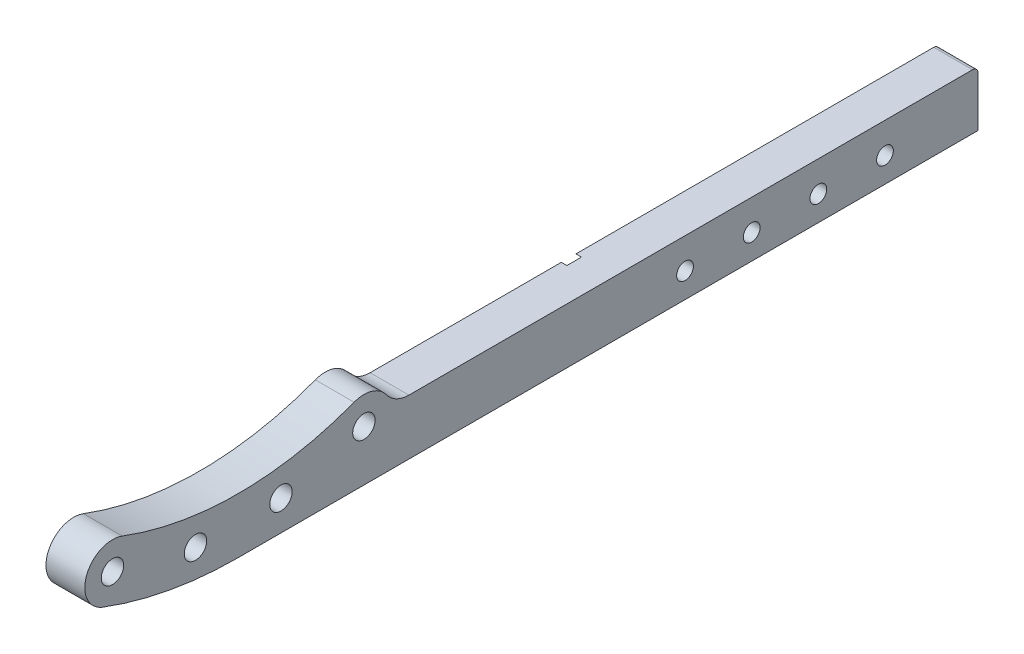
ISO-10303-21;
HEADER;
FILE_DESCRIPTION(('STEP AP214'),'2;1');
FILE_NAME('part.step','',(''),(''),'','','');
FILE_SCHEMA(('AUTOMOTIVE_DESIGN { 1 0 10303 214 1 1 1 1 }'));
ENDSEC;
DATA;
#1=APPLICATION_CONTEXT('core data for automotive mechanical design processes');
#2=APPLICATION_PROTOCOL_DEFINITION('international standard','automotive_design',2000,#1);
#3=PRODUCT_CONTEXT('',#1,'mechanical');
#4=PRODUCT('Part','Part','',(#3));
#5=PRODUCT_RELATED_PRODUCT_CATEGORY('part','',(#4));
#6=PRODUCT_DEFINITION_FORMATION('','',#4);
#7=PRODUCT_DEFINITION_CONTEXT('part definition',#1,'design');
#8=PRODUCT_DEFINITION('design','',#6,#7);
#9=PRODUCT_DEFINITION_SHAPE('','',#8);
#10=(LENGTH_UNIT() NAMED_UNIT(*) SI_UNIT(.MILLI.,.METRE.));
#11=(NAMED_UNIT(*) PLANE_ANGLE_UNIT() SI_UNIT($,.RADIAN.));
#12=(NAMED_UNIT(*) SI_UNIT($,.STERADIAN.) SOLID_ANGLE_UNIT());
#13=UNCERTAINTY_MEASURE_WITH_UNIT(LENGTH_MEASURE(1.E-05),#10,'distance_accuracy_value','');
#14=(GEOMETRIC_REPRESENTATION_CONTEXT(3) GLOBAL_UNCERTAINTY_ASSIGNED_CONTEXT((#13)) GLOBAL_UNIT_ASSIGNED_CONTEXT((#10,
#11,#12)) REPRESENTATION_CONTEXT('',''));
#15=CARTESIAN_POINT('',(0.,0.,0.));
#16=DIRECTION('',(0.,0.,1.));
#17=DIRECTION('',(1.,0.,0.));
#18=AXIS2_PLACEMENT_3D('',#15,#16,#17);
#19=CARTESIAN_POINT('',(32.002,-62.7448141057171,-66.6150937914129));
#20=DIRECTION('',(-1.,0.,0.));
#21=DIRECTION('',(0.,0.,1.));
#22=AXIS2_PLACEMENT_3D('',#19,#20,#21);
#23=CYLINDRICAL_SURFACE('',#22,4.);
#24=DIRECTION('',(-1.,0.,0.));
#25=VECTOR('',#24,1.);
#26=CARTESIAN_POINT('',(32.002,-58.9663869809709,-67.9279107866493));
#27=LINE('',#26,#25);
#28=CARTESIAN_POINT('',(32.,-58.9663869809709,-67.9279107866493));
#29=VERTEX_POINT('',#28);
#30=CARTESIAN_POINT('',(31.,-58.9663869809709,-67.9279107866493));
#31=VERTEX_POINT('',#30);
#32=EDGE_CURVE('E213',#29,#31,#27,.T.);
#33=ORIENTED_EDGE('',*,*,#32,.T.);
#34=CARTESIAN_POINT('',(31.,-62.7448141057171,-66.6150937914129));
#35=DIRECTION('',(-1.,0.,0.));
#36=DIRECTION('',(0.,0.,1.));
#37=AXIS2_PLACEMENT_3D('',#34,#35,#36);
#38=CIRCLE('',#37,4.);
#39=CARTESIAN_POINT('',(31.,-59.916386980971,-69.4435209161591));
#40=VERTEX_POINT('',#39);
#41=EDGE_CURVE('E229',#31,#40,#38,.T.);
#42=ORIENTED_EDGE('',*,*,#41,.T.);
#43=DIRECTION('',(-1.,0.,0.));
#44=VECTOR('',#43,1.);
#45=CARTESIAN_POINT('',(32.002,-59.916386980971,-69.4435209161591));
#46=LINE('',#45,#44);
#47=CARTESIAN_POINT('',(32.,-59.916386980971,-69.4435209161591));
#48=VERTEX_POINT('',#47);
#49=EDGE_CURVE('E11',#48,#40,#46,.T.);
#50=ORIENTED_EDGE('',*,*,#49,.F.);
#51=CARTESIAN_POINT('',(32.,-62.7448141057171,-66.6150937914129));
#52=DIRECTION('',(-1.,0.,0.));
#53=DIRECTION('',(0.,0.,-1.));
#54=AXIS2_PLACEMENT_3D('',#51,#52,#53);
#55=CIRCLE('',#54,4.);
#56=EDGE_CURVE('E348',#29,#48,#55,.T.);
#57=ORIENTED_EDGE('',*,*,#56,.F.);
#58=EDGE_LOOP('',(#33,#42,#50,#57));
#59=FACE_BOUND('',#58,.T.);
#60=ADVANCED_FACE('F16',(#59),#23,.F.);
#61=CARTESIAN_POINT('',(32.002,-62.7448141057171,-66.6150937914129));
#62=DIRECTION('',(-1.,0.,0.));
#63=DIRECTION('',(0.,0.,1.));
#64=AXIS2_PLACEMENT_3D('',#61,#62,#63);
#65=CYLINDRICAL_SURFACE('',#64,4.);
#66=DIRECTION('',(-1.,0.,0.));
#67=VECTOR('',#66,1.);
#68=CARTESIAN_POINT('',(32.002,-65.5732412304633,-63.7866666666667));
#69=LINE('',#68,#67);
#70=CARTESIAN_POINT('',(32.,-65.5732412304633,-63.7866666666667));
#71=VERTEX_POINT('',#70);
#72=CARTESIAN_POINT('',(31.,-65.5732412304633,-63.7866666666667));
#73=VERTEX_POINT('',#72);
#74=EDGE_CURVE('E263',#71,#73,#69,.T.);
#75=ORIENTED_EDGE('',*,*,#74,.T.);
#76=CARTESIAN_POINT('',(31.,-62.7448141057171,-66.6150937914129));
#77=DIRECTION('',(-1.,0.,0.));
#78=DIRECTION('',(0.,0.,1.));
#79=AXIS2_PLACEMENT_3D('',#76,#77,#78);
#80=CIRCLE('',#79,4.);
#81=CARTESIAN_POINT('',(31.,-58.9663869809709,-65.3022767961764));
#82=VERTEX_POINT('',#81);
#83=EDGE_CURVE('E250',#73,#82,#80,.T.);
#84=ORIENTED_EDGE('',*,*,#83,.T.);
#85=DIRECTION('',(-1.,0.,0.));
#86=VECTOR('',#85,1.);
#87=CARTESIAN_POINT('',(32.002,-58.9663869809709,-65.3022767961764));
#88=LINE('',#87,#86);
#89=CARTESIAN_POINT('',(32.,-58.9663869809709,-65.3022767961764));
#90=VERTEX_POINT('',#89);
#91=EDGE_CURVE('E374',#90,#82,#88,.T.);
#92=ORIENTED_EDGE('',*,*,#91,.F.);
#93=CARTESIAN_POINT('',(32.,-62.7448141057171,-66.6150937914129));
#94=DIRECTION('',(-1.,0.,0.));
#95=DIRECTION('',(0.,0.,-1.));
#96=AXIS2_PLACEMENT_3D('',#93,#94,#95);
#97=CIRCLE('',#96,4.);
#98=EDGE_CURVE('E341',#71,#90,#97,.T.);
#99=ORIENTED_EDGE('',*,*,#98,.F.);
#100=EDGE_LOOP('',(#75,#84,#92,#99));
#101=FACE_BOUND('',#100,.T.);
#102=ADVANCED_FACE('F593',(#101),#65,.F.);
#103=CARTESIAN_POINT('',(31.,-59.916386980971,-98.6566666666667));
#104=DIRECTION('',(0.,1.,0.));
#105=DIRECTION('',(1.,0.,0.));
#106=AXIS2_PLACEMENT_3D('',#103,#104,#105);
#107=PLANE('',#106);
#108=DIRECTION('',(0.,0.,1.));
#109=VECTOR('',#108,1.);
#110=CARTESIAN_POINT('',(32.,-59.916386980971,-33.7426398428481));
#111=LINE('',#110,#109);
#112=CARTESIAN_POINT('',(32.,-59.916386980971,-133.475415884439));
#113=VERTEX_POINT('',#112);
#114=EDGE_CURVE('E357',#113,#48,#111,.T.);
#115=ORIENTED_EDGE('',*,*,#114,.T.);
#116=ORIENTED_EDGE('',*,*,#49,.T.);
#117=DIRECTION('',(0.,0.,1.));
#118=VECTOR('',#117,1.);
#119=CARTESIAN_POINT('',(31.,-59.916386980971,-33.7426398428481));
#120=LINE('',#119,#118);
#121=CARTESIAN_POINT('',(31.,-59.916386980971,-133.475415884439));
#122=VERTEX_POINT('',#121);
#123=EDGE_CURVE('E225',#122,#40,#120,.T.);
#124=ORIENTED_EDGE('',*,*,#123,.F.);
#125=DIRECTION('',(1.,0.,0.));
#126=VECTOR('',#125,1.);
#127=CARTESIAN_POINT('',(38.,-59.916386980971,-133.475415884439));
#128=LINE('',#127,#126);
#129=EDGE_CURVE('E220',#122,#113,#128,.T.);
#130=ORIENTED_EDGE('',*,*,#129,.T.);
#131=EDGE_LOOP('',(#115,#116,#124,#130));
#132=FACE_BOUND('',#131,.T.);
#133=ADVANCED_FACE('F597',(#132),#107,.F.);
#134=CARTESIAN_POINT('',(38.,0.,-33.7426398428481));
#135=DIRECTION('',(1.,0.,0.));
#136=DIRECTION('',(0.,1.,0.));
#137=AXIS2_PLACEMENT_3D('',#134,#135,#136);
#138=PLANE('',#137);
#139=CARTESIAN_POINT('',(38.,-64.466386980971,-116.694166666667));
#140=DIRECTION('',(1.,0.,0.));
#141=DIRECTION('',(0.,0.,-1.));
#142=AXIS2_PLACEMENT_3D('',#139,#140,#141);
#143=CIRCLE('',#142,1.5125);
#144=CARTESIAN_POINT('',(38.,-64.466386980971,-118.206666666667));
#145=VERTEX_POINT('',#144);
#146=EDGE_CURVE('E26',#145,#145,#143,.T.);
#147=ORIENTED_EDGE('',*,*,#146,.F.);
#148=EDGE_LOOP('',(#147));
#149=FACE_BOUND('',#148,.T.);
#150=CARTESIAN_POINT('',(38.,-64.466386980971,-104.669166666667));
#151=DIRECTION('',(1.,0.,0.));
#152=DIRECTION('',(0.,0.,-1.));
#153=AXIS2_PLACEMENT_3D('',#150,#151,#152);
#154=CIRCLE('',#153,1.5125);
#155=CARTESIAN_POINT('',(38.,-64.466386980971,-106.181666666667));
#156=VERTEX_POINT('',#155);
#157=EDGE_CURVE('E328',#156,#156,#154,.T.);
#158=ORIENTED_EDGE('',*,*,#157,.F.);
#159=EDGE_LOOP('',(#158));
#160=FACE_BOUND('',#159,.T.);
#161=CARTESIAN_POINT('',(38.,-64.466386980971,-92.6441666666667));
#162=DIRECTION('',(1.,0.,0.));
#163=DIRECTION('',(0.,0.,-1.));
#164=AXIS2_PLACEMENT_3D('',#161,#162,#163);
#165=CIRCLE('',#164,1.5125);
#166=CARTESIAN_POINT('',(38.,-64.466386980971,-94.1566666666667));
#167=VERTEX_POINT('',#166);
#168=EDGE_CURVE('E331',#167,#167,#165,.T.);
#169=ORIENTED_EDGE('',*,*,#168,.F.);
#170=EDGE_LOOP('',(#169));
#171=FACE_BOUND('',#170,.T.);
#172=CARTESIAN_POINT('',(38.,-64.466386980971,-80.6191666666666));
#173=DIRECTION('',(1.,0.,0.));
#174=DIRECTION('',(0.,0.,-1.));
#175=AXIS2_PLACEMENT_3D('',#172,#173,#174);
#176=CIRCLE('',#175,1.5125);
#177=CARTESIAN_POINT('',(38.,-64.466386980971,-82.1316666666666));
#178=VERTEX_POINT('',#177);
#179=EDGE_CURVE('E240',#178,#178,#176,.T.);
#180=ORIENTED_EDGE('',*,*,#179,.F.);
#181=EDGE_LOOP('',(#180));
#182=FACE_BOUND('',#181,.T.);
#183=CARTESIAN_POINT('',(38.,-63.5,7.71029593461356));
#184=DIRECTION('',(1.,0.,0.));
#185=DIRECTION('',(0.,0.,-1.));
#186=AXIS2_PLACEMENT_3D('',#183,#184,#185);
#187=CIRCLE('',#186,2.025);
#188=CARTESIAN_POINT('',(38.,-63.5,5.68529593461356));
#189=VERTEX_POINT('',#188);
#190=EDGE_CURVE('E242',#189,#189,#187,.T.);
#191=ORIENTED_EDGE('',*,*,#190,.F.);
#192=EDGE_LOOP('',(#191));
#193=FACE_BOUND('',#192,.T.);
#194=CARTESIAN_POINT('',(38.,-59.8096108131086,22.6827934299063));
#195=DIRECTION('',(1.,0.,0.));
#196=DIRECTION('',(0.,0.,-1.));
#197=AXIS2_PLACEMENT_3D('',#194,#195,#196);
#198=CIRCLE('',#197,2.025);
#199=CARTESIAN_POINT('',(38.,-59.8096108131086,20.6577934299063));
#200=VERTEX_POINT('',#199);
#201=EDGE_CURVE('E245',#200,#200,#198,.T.);
#202=ORIENTED_EDGE('',*,*,#201,.F.);
#203=EDGE_LOOP('',(#202));
#204=FACE_BOUND('',#203,.T.);
#205=CARTESIAN_POINT('',(38.,-59.8096108131086,-22.6827934299063));
#206=DIRECTION('',(1.,0.,0.));
#207=DIRECTION('',(0.,0.,-1.));
#208=AXIS2_PLACEMENT_3D('',#205,#206,#207);
#209=CIRCLE('',#208,2.025);
#210=CARTESIAN_POINT('',(38.,-59.8096108131086,-24.7077934299063));
#211=VERTEX_POINT('',#210);
#212=EDGE_CURVE('E281',#211,#211,#209,.T.);
#213=ORIENTED_EDGE('',*,*,#212,.F.);
#214=EDGE_LOOP('',(#213));
#215=FACE_BOUND('',#214,.T.);
#216=CARTESIAN_POINT('',(38.,-63.5,-7.71029593461356));
#217=DIRECTION('',(1.,0.,0.));
#218=DIRECTION('',(0.,0.,-1.));
#219=AXIS2_PLACEMENT_3D('',#216,#217,#218);
#220=CIRCLE('',#219,2.025);
#221=CARTESIAN_POINT('',(38.,-63.5,-9.73529593461356));
#222=VERTEX_POINT('',#221);
#223=EDGE_CURVE('E277',#222,#222,#220,.T.);
#224=ORIENTED_EDGE('',*,*,#223,.F.);
#225=EDGE_LOOP('',(#224));
#226=FACE_BOUND('',#225,.T.);
#227=DIRECTION('',(0.,0.,-1.));
#228=VECTOR('',#227,1.);
#229=CARTESIAN_POINT('',(38.,-68.966386980971,-31.9183333333333));
#230=LINE('',#229,#228);
#231=CARTESIAN_POINT('',(38.,-68.966386980971,0.));
#232=VERTEX_POINT('',#231);
#233=CARTESIAN_POINT('',(38.,-68.966386980971,-133.476666666667));
#234=VERTEX_POINT('',#233);
#235=EDGE_CURVE('E304',#232,#234,#230,.T.);
#236=ORIENTED_EDGE('',*,*,#235,.T.);
#237=DIRECTION('',(0.,1.,0.));
#238=VECTOR('',#237,1.);
#239=CARTESIAN_POINT('',(38.,-64.4663869809709,-133.476666666667));
#240=LINE('',#239,#238);
#241=CARTESIAN_POINT('',(38.,-59.966386980971,-133.476666666667));
#242=VERTEX_POINT('',#241);
#243=EDGE_CURVE('E343',#234,#242,#240,.T.);
#244=ORIENTED_EDGE('',*,*,#243,.T.);
#245=CARTESIAN_POINT('',(38.,-59.9663869809709,-132.476666666667));
#246=DIRECTION('',(1.,0.,0.));
#247=DIRECTION('',(0.,0.,-1.));
#248=AXIS2_PLACEMENT_3D('',#245,#246,#247);
#249=CIRCLE('',#248,1.00000000000005);
#250=CARTESIAN_POINT('',(38.,-58.9663869809708,-132.476666666667));
#251=VERTEX_POINT('',#250);
#252=EDGE_CURVE('E295',#242,#251,#249,.T.);
#253=ORIENTED_EDGE('',*,*,#252,.T.);
#254=DIRECTION('',(0.,0.,-1.));
#255=VECTOR('',#254,1.);
#256=CARTESIAN_POINT('',(38.,-58.9663869809709,-81.6373381875584));
#257=LINE('',#256,#255);
#258=CARTESIAN_POINT('',(38.,-58.9663869809709,-30.7980097084498));
#259=VERTEX_POINT('',#258);
#260=EDGE_CURVE('E210',#259,#251,#257,.T.);
#261=ORIENTED_EDGE('',*,*,#260,.F.);
#262=CARTESIAN_POINT('',(38.,-53.9663869809708,-30.7980097084498));
#263=DIRECTION('',(1.,0.,0.));
#264=DIRECTION('',(0.,0.,-1.));
#265=AXIS2_PLACEMENT_3D('',#262,#263,#264);
#266=CIRCLE('',#265,5.);
#267=CARTESIAN_POINT('',(38.,-56.8879988970397,-26.740401569178));
#268=VERTEX_POINT('',#267);
#269=EDGE_CURVE('E290',#268,#259,#266,.T.);
#270=ORIENTED_EDGE('',*,*,#269,.F.);
#271=CARTESIAN_POINT('',(38.,-59.8096108131086,-22.6827934299063));
#272=DIRECTION('',(-1.,0.,0.));
#273=DIRECTION('',(0.,0.,-1.));
#274=AXIS2_PLACEMENT_3D('',#271,#272,#273);
#275=CIRCLE('',#274,5.);
#276=CARTESIAN_POINT('',(38.,-55.1345295996815,-20.9097689946937));
#277=VERTEX_POINT('',#276);
#278=EDGE_CURVE('E320',#277,#268,#275,.T.);
#279=ORIENTED_EDGE('',*,*,#278,.F.);
#280=CARTESIAN_POINT('',(38.,0.,0.));
#281=DIRECTION('',(1.,0.,0.));
#282=DIRECTION('',(0.,0.,-1.));
#283=AXIS2_PLACEMENT_3D('',#280,#281,#282);
#284=CIRCLE('',#283,58.9663869809709);
#285=CARTESIAN_POINT('',(38.,-55.1345295996815,20.9097689946936));
#286=VERTEX_POINT('',#285);
#287=EDGE_CURVE('E319',#286,#277,#284,.T.);
#288=ORIENTED_EDGE('',*,*,#287,.F.);
#289=CARTESIAN_POINT('',(38.,-59.8096108131086,22.6827934299063));
#290=DIRECTION('',(-1.,0.,0.));
#291=DIRECTION('',(0.,0.,-1.));
#292=AXIS2_PLACEMENT_3D('',#289,#290,#291);
#293=CIRCLE('',#292,5.);
#294=CARTESIAN_POINT('',(38.,-64.4846920265357,24.455817865119));
#295=VERTEX_POINT('',#294);
#296=EDGE_CURVE('E332',#295,#286,#293,.T.);
#297=ORIENTED_EDGE('',*,*,#296,.F.);
#298=CARTESIAN_POINT('',(38.,0.,0.));
#299=DIRECTION('',(-1.,0.,0.));
#300=DIRECTION('',(0.,0.,-1.));
#301=AXIS2_PLACEMENT_3D('',#298,#299,#300);
#302=CIRCLE('',#301,68.966386980971);
#303=EDGE_CURVE('E280',#232,#295,#302,.T.);
#304=ORIENTED_EDGE('',*,*,#303,.F.);
#305=EDGE_LOOP('',(#236,#244,#253,#261,#270,#279,#288,#297,#304));
#306=FACE_BOUND('',#305,.T.);
#307=ADVANCED_FACE('F575',(#149,#160,#171,#182,#193,#204,#215,#226,#306),#138,.T.);
#308=CARTESIAN_POINT('',(38.,-64.466386980971,-116.694166666667));
#309=DIRECTION('',(-1.,0.,0.));
#310=DIRECTION('',(0.,0.,1.));
#311=AXIS2_PLACEMENT_3D('',#308,#309,#310);
#312=CYLINDRICAL_SURFACE('',#311,1.5125);
#313=CARTESIAN_POINT('',(32.,-64.466386980971,-116.694166666667));
#314=DIRECTION('',(1.,0.,0.));
#315=DIRECTION('',(0.,0.,-1.));
#316=AXIS2_PLACEMENT_3D('',#313,#314,#315);
#317=CIRCLE('',#316,1.5125);
#318=CARTESIAN_POINT('',(32.,-64.466386980971,-118.206666666667));
#319=VERTEX_POINT('',#318);
#320=EDGE_CURVE('E398',#319,#319,#317,.T.);
#321=ORIENTED_EDGE('',*,*,#320,.F.);
#322=EDGE_LOOP('',(#321));
#323=FACE_BOUND('',#322,.T.);
#324=ORIENTED_EDGE('',*,*,#146,.T.);
#325=EDGE_LOOP('',(#324));
#326=FACE_BOUND('',#325,.T.);
#327=ADVANCED_FACE('F620',(#323,#326),#312,.F.);
#328=CARTESIAN_POINT('',(38.,0.,0.));
#329=DIRECTION('',(-1.,0.,0.));
#330=DIRECTION('',(0.,0.,1.));
#331=AXIS2_PLACEMENT_3D('',#328,#329,#330);
#332=CYLINDRICAL_SURFACE('',#331,68.966386980971);
#333=DIRECTION('',(-1.,0.,0.));
#334=VECTOR('',#333,1.);
#335=CARTESIAN_POINT('',(38.,-64.4846920265357,24.455817865119));
#336=LINE('',#335,#334);
#337=CARTESIAN_POINT('',(31.,-64.4846920265357,24.455817865119));
#338=VERTEX_POINT('',#337);
#339=EDGE_CURVE('E402',#295,#338,#336,.T.);
#340=ORIENTED_EDGE('',*,*,#339,.T.);
#341=CARTESIAN_POINT('',(31.,0.,0.));
#342=DIRECTION('',(-1.,0.,0.));
#343=DIRECTION('',(0.,0.,-1.));
#344=AXIS2_PLACEMENT_3D('',#341,#342,#343);
#345=CIRCLE('',#344,68.966386980971);
#346=CARTESIAN_POINT('',(31.,-68.966386980971,0.));
#347=VERTEX_POINT('',#346);
#348=EDGE_CURVE('E389',#347,#338,#345,.T.);
#349=ORIENTED_EDGE('',*,*,#348,.F.);
#350=DIRECTION('',(-1.,0.,0.));
#351=VECTOR('',#350,1.);
#352=CARTESIAN_POINT('',(38.,-68.966386980971,0.));
#353=LINE('',#352,#351);
#354=EDGE_CURVE('E268',#232,#347,#353,.T.);
#355=ORIENTED_EDGE('',*,*,#354,.F.);
#356=ORIENTED_EDGE('',*,*,#303,.T.);
#357=EDGE_LOOP('',(#340,#349,#355,#356));
#358=FACE_BOUND('',#357,.T.);
#359=ADVANCED_FACE('F421',(#358),#332,.T.);
#360=CARTESIAN_POINT('',(38.,-63.5,-7.71029593461356));
#361=DIRECTION('',(-1.,0.,0.));
#362=DIRECTION('',(0.,0.,1.));
#363=AXIS2_PLACEMENT_3D('',#360,#361,#362);
#364=CYLINDRICAL_SURFACE('',#363,2.025);
#365=CARTESIAN_POINT('',(31.,-63.5,-7.71029593461356));
#366=DIRECTION('',(1.,0.,0.));
#367=DIRECTION('',(0.,0.,-1.));
#368=AXIS2_PLACEMENT_3D('',#365,#366,#367);
#369=CIRCLE('',#368,2.025);
#370=CARTESIAN_POINT('',(31.,-63.5,-9.73529593461356));
#371=VERTEX_POINT('',#370);
#372=EDGE_CURVE('E276',#371,#371,#369,.T.);
#373=ORIENTED_EDGE('',*,*,#372,.F.);
#374=EDGE_LOOP('',(#373));
#375=FACE_BOUND('',#374,.T.);
#376=ORIENTED_EDGE('',*,*,#223,.T.);
#377=EDGE_LOOP('',(#376));
#378=FACE_BOUND('',#377,.T.);
#379=ADVANCED_FACE('F628',(#375,#378),#364,.F.);
#380=CARTESIAN_POINT('',(38.,-59.8096108131086,-22.6827934299063));
#381=DIRECTION('',(-1.,0.,0.));
#382=DIRECTION('',(0.,0.,1.));
#383=AXIS2_PLACEMENT_3D('',#380,#381,#382);
#384=CYLINDRICAL_SURFACE('',#383,2.025);
#385=CARTESIAN_POINT('',(31.,-59.8096108131086,-22.6827934299063));
#386=DIRECTION('',(1.,0.,0.));
#387=DIRECTION('',(0.,0.,-1.));
#388=AXIS2_PLACEMENT_3D('',#385,#386,#387);
#389=CIRCLE('',#388,2.025);
#390=CARTESIAN_POINT('',(31.,-59.8096108131086,-24.7077934299063));
#391=VERTEX_POINT('',#390);
#392=EDGE_CURVE('E272',#391,#391,#389,.T.);
#393=ORIENTED_EDGE('',*,*,#392,.F.);
#394=EDGE_LOOP('',(#393));
#395=FACE_BOUND('',#394,.T.);
#396=ORIENTED_EDGE('',*,*,#212,.T.);
#397=EDGE_LOOP('',(#396));
#398=FACE_BOUND('',#397,.T.);
#399=ADVANCED_FACE('F630',(#395,#398),#384,.F.);
#400=CARTESIAN_POINT('',(38.,-59.8096108131086,22.6827934299063));
#401=DIRECTION('',(-1.,0.,0.));
#402=DIRECTION('',(0.,0.,1.));
#403=AXIS2_PLACEMENT_3D('',#400,#401,#402);
#404=CYLINDRICAL_SURFACE('',#403,2.025);
#405=CARTESIAN_POINT('',(31.,-59.8096108131086,22.6827934299063));
#406=DIRECTION('',(1.,0.,0.));
#407=DIRECTION('',(0.,0.,-1.));
#408=AXIS2_PLACEMENT_3D('',#405,#406,#407);
#409=CIRCLE('',#408,2.025);
#410=CARTESIAN_POINT('',(31.,-59.8096108131086,20.6577934299063));
#411=VERTEX_POINT('',#410);
#412=EDGE_CURVE('E275',#411,#411,#409,.T.);
#413=ORIENTED_EDGE('',*,*,#412,.F.);
#414=EDGE_LOOP('',(#413));
#415=FACE_BOUND('',#414,.T.);
#416=ORIENTED_EDGE('',*,*,#201,.T.);
#417=EDGE_LOOP('',(#416));
#418=FACE_BOUND('',#417,.T.);
#419=ADVANCED_FACE('F614',(#415,#418),#404,.F.);
#420=CARTESIAN_POINT('',(38.,-63.5,7.71029593461356));
#421=DIRECTION('',(-1.,0.,0.));
#422=DIRECTION('',(0.,0.,1.));
#423=AXIS2_PLACEMENT_3D('',#420,#421,#422);
#424=CYLINDRICAL_SURFACE('',#423,2.025);
#425=CARTESIAN_POINT('',(31.,-63.5,7.71029593461356));
#426=DIRECTION('',(1.,0.,0.));
#427=DIRECTION('',(0.,0.,-1.));
#428=AXIS2_PLACEMENT_3D('',#425,#426,#427);
#429=CIRCLE('',#428,2.025);
#430=CARTESIAN_POINT('',(31.,-63.5,5.68529593461356));
#431=VERTEX_POINT('',#430);
#432=EDGE_CURVE('E251',#431,#431,#429,.T.);
#433=ORIENTED_EDGE('',*,*,#432,.F.);
#434=EDGE_LOOP('',(#433));
#435=FACE_BOUND('',#434,.T.);
#436=ORIENTED_EDGE('',*,*,#190,.T.);
#437=EDGE_LOOP('',(#436));
#438=FACE_BOUND('',#437,.T.);
#439=ADVANCED_FACE('F610',(#435,#438),#424,.F.);
#440=CARTESIAN_POINT('',(38.,-64.466386980971,-80.6191666666666));
#441=DIRECTION('',(-1.,0.,0.));
#442=DIRECTION('',(0.,0.,1.));
#443=AXIS2_PLACEMENT_3D('',#440,#441,#442);
#444=CYLINDRICAL_SURFACE('',#443,1.5125);
#445=CARTESIAN_POINT('',(32.,-64.466386980971,-80.6191666666666));
#446=DIRECTION('',(1.,0.,0.));
#447=DIRECTION('',(0.,0.,-1.));
#448=AXIS2_PLACEMENT_3D('',#445,#446,#447);
#449=CIRCLE('',#448,1.5125);
#450=CARTESIAN_POINT('',(32.,-64.466386980971,-82.1316666666666));
#451=VERTEX_POINT('',#450);
#452=EDGE_CURVE('E338',#451,#451,#449,.T.);
#453=ORIENTED_EDGE('',*,*,#452,.F.);
#454=EDGE_LOOP('',(#453));
#455=FACE_BOUND('',#454,.T.);
#456=ORIENTED_EDGE('',*,*,#179,.T.);
#457=EDGE_LOOP('',(#456));
#458=FACE_BOUND('',#457,.T.);
#459=ADVANCED_FACE('F613',(#455,#458),#444,.F.);
#460=CARTESIAN_POINT('',(38.,-64.466386980971,-92.6441666666667));
#461=DIRECTION('',(-1.,0.,0.));
#462=DIRECTION('',(0.,0.,1.));
#463=AXIS2_PLACEMENT_3D('',#460,#461,#462);
#464=CYLINDRICAL_SURFACE('',#463,1.5125);
#465=CARTESIAN_POINT('',(32.,-64.466386980971,-92.6441666666667));
#466=DIRECTION('',(1.,0.,0.));
#467=DIRECTION('',(0.,0.,-1.));
#468=AXIS2_PLACEMENT_3D('',#465,#466,#467);
#469=CIRCLE('',#468,1.5125);
#470=CARTESIAN_POINT('',(32.,-64.466386980971,-94.1566666666667));
#471=VERTEX_POINT('',#470);
#472=EDGE_CURVE('E342',#471,#471,#469,.T.);
#473=ORIENTED_EDGE('',*,*,#472,.F.);
#474=EDGE_LOOP('',(#473));
#475=FACE_BOUND('',#474,.T.);
#476=ORIENTED_EDGE('',*,*,#168,.T.);
#477=EDGE_LOOP('',(#476));
#478=FACE_BOUND('',#477,.T.);
#479=ADVANCED_FACE('F658',(#475,#478),#464,.F.);
#480=CARTESIAN_POINT('',(38.,-64.466386980971,-104.669166666667));
#481=DIRECTION('',(-1.,0.,0.));
#482=DIRECTION('',(0.,0.,1.));
#483=AXIS2_PLACEMENT_3D('',#480,#481,#482);
#484=CYLINDRICAL_SURFACE('',#483,1.5125);
#485=CARTESIAN_POINT('',(32.,-64.466386980971,-104.669166666667));
#486=DIRECTION('',(1.,0.,0.));
#487=DIRECTION('',(0.,0.,-1.));
#488=AXIS2_PLACEMENT_3D('',#485,#486,#487);
#489=CIRCLE('',#488,1.5125);
#490=CARTESIAN_POINT('',(32.,-64.466386980971,-106.181666666667));
#491=VERTEX_POINT('',#490);
#492=EDGE_CURVE('E401',#491,#491,#489,.T.);
#493=ORIENTED_EDGE('',*,*,#492,.F.);
#494=EDGE_LOOP('',(#493));
#495=FACE_BOUND('',#494,.T.);
#496=ORIENTED_EDGE('',*,*,#157,.T.);
#497=EDGE_LOOP('',(#496));
#498=FACE_BOUND('',#497,.T.);
#499=ADVANCED_FACE('F660',(#495,#498),#484,.F.);
#500=CARTESIAN_POINT('',(38.,-59.8096108131086,22.6827934299063));
#501=DIRECTION('',(-1.,0.,0.));
#502=DIRECTION('',(0.,0.,1.));
#503=AXIS2_PLACEMENT_3D('',#500,#501,#502);
#504=CYLINDRICAL_SURFACE('',#503,5.);
#505=DIRECTION('',(-1.,0.,0.));
#506=VECTOR('',#505,1.);
#507=CARTESIAN_POINT('',(38.,-55.1345295996815,20.9097689946936));
#508=LINE('',#507,#506);
#509=CARTESIAN_POINT('',(31.,-55.1345295996815,20.9097689946936));
#510=VERTEX_POINT('',#509);
#511=EDGE_CURVE('E316',#286,#510,#508,.T.);
#512=ORIENTED_EDGE('',*,*,#511,.T.);
#513=CARTESIAN_POINT('',(31.,-59.8096108131086,22.6827934299063));
#514=DIRECTION('',(-1.,0.,0.));
#515=DIRECTION('',(0.,0.,-1.));
#516=AXIS2_PLACEMENT_3D('',#513,#514,#515);
#517=CIRCLE('',#516,5.);
#518=EDGE_CURVE('E381',#338,#510,#517,.T.);
#519=ORIENTED_EDGE('',*,*,#518,.F.);
#520=ORIENTED_EDGE('',*,*,#339,.F.);
#521=ORIENTED_EDGE('',*,*,#296,.T.);
#522=EDGE_LOOP('',(#512,#519,#520,#521));
#523=FACE_BOUND('',#522,.T.);
#524=ADVANCED_FACE('F583',(#523),#504,.T.);
#525=CARTESIAN_POINT('',(38.,0.,0.));
#526=DIRECTION('',(-1.,0.,0.));
#527=DIRECTION('',(0.,0.,1.));
#528=AXIS2_PLACEMENT_3D('',#525,#526,#527);
#529=CYLINDRICAL_SURFACE('',#528,58.9663869809709);
#530=DIRECTION('',(-1.,0.,0.));
#531=VECTOR('',#530,1.);
#532=CARTESIAN_POINT('',(38.,-55.1345295996815,-20.9097689946937));
#533=LINE('',#532,#531);
#534=CARTESIAN_POINT('',(31.,-55.1345295996815,-20.9097689946937));
#535=VERTEX_POINT('',#534);
#536=EDGE_CURVE('E293',#277,#535,#533,.T.);
#537=ORIENTED_EDGE('',*,*,#536,.T.);
#538=CARTESIAN_POINT('',(31.,0.,0.));
#539=DIRECTION('',(1.,0.,0.));
#540=DIRECTION('',(0.,0.,-1.));
#541=AXIS2_PLACEMENT_3D('',#538,#539,#540);
#542=CIRCLE('',#541,58.9663869809709);
#543=EDGE_CURVE('E377',#510,#535,#542,.T.);
#544=ORIENTED_EDGE('',*,*,#543,.F.);
#545=ORIENTED_EDGE('',*,*,#511,.F.);
#546=ORIENTED_EDGE('',*,*,#287,.T.);
#547=EDGE_LOOP('',(#537,#544,#545,#546));
#548=FACE_BOUND('',#547,.T.);
#549=ADVANCED_FACE('F568',(#548),#529,.F.);
#550=CARTESIAN_POINT('',(38.,-59.8096108131086,-22.6827934299063));
#551=DIRECTION('',(-1.,0.,0.));
#552=DIRECTION('',(0.,0.,1.));
#553=AXIS2_PLACEMENT_3D('',#550,#551,#552);
#554=CYLINDRICAL_SURFACE('',#553,5.);
#555=DIRECTION('',(-1.,0.,0.));
#556=VECTOR('',#555,1.);
#557=CARTESIAN_POINT('',(38.,-56.8879988970397,-26.740401569178));
#558=LINE('',#557,#556);
#559=CARTESIAN_POINT('',(31.,-56.8879988970397,-26.740401569178));
#560=VERTEX_POINT('',#559);
#561=EDGE_CURVE('E294',#268,#560,#558,.T.);
#562=ORIENTED_EDGE('',*,*,#561,.T.);
#563=CARTESIAN_POINT('',(31.,-59.8096108131086,-22.6827934299063));
#564=DIRECTION('',(-1.,0.,0.));
#565=DIRECTION('',(0.,0.,-1.));
#566=AXIS2_PLACEMENT_3D('',#563,#564,#565);
#567=CIRCLE('',#566,5.);
#568=EDGE_CURVE('E257',#535,#560,#567,.T.);
#569=ORIENTED_EDGE('',*,*,#568,.F.);
#570=ORIENTED_EDGE('',*,*,#536,.F.);
#571=ORIENTED_EDGE('',*,*,#278,.T.);
#572=EDGE_LOOP('',(#562,#569,#570,#571));
#573=FACE_BOUND('',#572,.T.);
#574=ADVANCED_FACE('F578',(#573),#554,.T.);
#575=CARTESIAN_POINT('',(38.,-53.9663869809708,-30.7980097084498));
#576=DIRECTION('',(-1.,0.,0.));
#577=DIRECTION('',(0.,0.,1.));
#578=AXIS2_PLACEMENT_3D('',#575,#576,#577);
#579=CYLINDRICAL_SURFACE('',#578,5.);
#580=DIRECTION('',(-1.,0.,0.));
#581=VECTOR('',#580,1.);
#582=CARTESIAN_POINT('',(38.,-58.9663869809709,-30.7980097084498));
#583=LINE('',#582,#581);
#584=CARTESIAN_POINT('',(31.,-58.9663869809709,-30.7980097084498));
#585=VERTEX_POINT('',#584);
#586=EDGE_CURVE('E312',#259,#585,#583,.T.);
#587=ORIENTED_EDGE('',*,*,#586,.T.);
#588=CARTESIAN_POINT('',(31.,-53.9663869809708,-30.7980097084498));
#589=DIRECTION('',(1.,0.,0.));
#590=DIRECTION('',(0.,0.,-1.));
#591=AXIS2_PLACEMENT_3D('',#588,#589,#590);
#592=CIRCLE('',#591,5.);
#593=EDGE_CURVE('E252',#560,#585,#592,.T.);
#594=ORIENTED_EDGE('',*,*,#593,.F.);
#595=ORIENTED_EDGE('',*,*,#561,.F.);
#596=ORIENTED_EDGE('',*,*,#269,.T.);
#597=EDGE_LOOP('',(#587,#594,#595,#596));
#598=FACE_BOUND('',#597,.T.);
#599=ADVANCED_FACE('F651',(#598),#579,.F.);
#600=CARTESIAN_POINT('',(38.,-59.9663869809709,-132.476666666667));
#601=DIRECTION('',(-1.,0.,0.));
#602=DIRECTION('',(0.,0.,1.));
#603=AXIS2_PLACEMENT_3D('',#600,#601,#602);
#604=CYLINDRICAL_SURFACE('',#603,1.00000000000005);
#605=DIRECTION('',(-1.,0.,0.));
#606=VECTOR('',#605,1.);
#607=CARTESIAN_POINT('',(38.,-59.966386980971,-133.476666666667));
#608=LINE('',#607,#606);
#609=CARTESIAN_POINT('',(32.,-59.966386980971,-133.476666666667));
#610=VERTEX_POINT('',#609);
#611=EDGE_CURVE('E308',#242,#610,#608,.T.);
#612=ORIENTED_EDGE('',*,*,#611,.T.);
#613=CARTESIAN_POINT('',(32.,-59.9663869809709,-132.476666666667));
#614=DIRECTION('',(1.,0.,0.));
#615=DIRECTION('',(0.,0.,-1.));
#616=AXIS2_PLACEMENT_3D('',#613,#614,#615);
#617=CIRCLE('',#616,1.00000000000005);
#618=EDGE_CURVE('E19',#610,#113,#617,.T.);
#619=ORIENTED_EDGE('',*,*,#618,.T.);
#620=ORIENTED_EDGE('',*,*,#129,.F.);
#621=CARTESIAN_POINT('',(31.,-59.9663869809709,-132.476666666667));
#622=DIRECTION('',(1.,0.,0.));
#623=DIRECTION('',(0.,0.,-1.));
#624=AXIS2_PLACEMENT_3D('',#621,#622,#623);
#625=CIRCLE('',#624,1.00000000000005);
#626=CARTESIAN_POINT('',(31.,-58.9663869809708,-132.476666666667));
#627=VERTEX_POINT('',#626);
#628=EDGE_CURVE('E216',#122,#627,#625,.T.);
#629=ORIENTED_EDGE('',*,*,#628,.T.);
#630=DIRECTION('',(-1.,0.,0.));
#631=VECTOR('',#630,1.);
#632=CARTESIAN_POINT('',(38.,-58.9663869809708,-132.476666666667));
#633=LINE('',#632,#631);
#634=EDGE_CURVE('E200',#251,#627,#633,.T.);
#635=ORIENTED_EDGE('',*,*,#634,.F.);
#636=ORIENTED_EDGE('',*,*,#252,.F.);
#637=EDGE_LOOP('',(#612,#619,#620,#629,#635,#636));
#638=FACE_BOUND('',#637,.T.);
#639=ADVANCED_FACE('F217',(#638),#604,.T.);
#640=CARTESIAN_POINT('',(38.,-64.4663869809709,-133.476666666667));
#641=DIRECTION('',(0.,0.,1.));
#642=DIRECTION('',(1.,0.,0.));
#643=AXIS2_PLACEMENT_3D('',#640,#641,#642);
#644=PLANE('',#643);
#645=DIRECTION('',(0.,1.,0.));
#646=VECTOR('',#645,1.);
#647=CARTESIAN_POINT('',(32.,-64.4663869809709,-133.476666666667));
#648=LINE('',#647,#646);
#649=CARTESIAN_POINT('',(32.,-68.966386980971,-133.476666666667));
#650=VERTEX_POINT('',#649);
#651=EDGE_CURVE('E269',#650,#610,#648,.T.);
#652=ORIENTED_EDGE('',*,*,#651,.T.);
#653=ORIENTED_EDGE('',*,*,#611,.F.);
#654=ORIENTED_EDGE('',*,*,#243,.F.);
#655=DIRECTION('',(-1.,0.,0.));
#656=VECTOR('',#655,1.);
#657=CARTESIAN_POINT('',(38.,-68.966386980971,-133.476666666667));
#658=LINE('',#657,#656);
#659=EDGE_CURVE('E309',#234,#650,#658,.T.);
#660=ORIENTED_EDGE('',*,*,#659,.T.);
#661=EDGE_LOOP('',(#652,#653,#654,#660));
#662=FACE_BOUND('',#661,.T.);
#663=ADVANCED_FACE('F446',(#662),#644,.F.);
#664=CARTESIAN_POINT('',(38.,-68.966386980971,-31.9183333333333));
#665=DIRECTION('',(0.,1.,0.));
#666=DIRECTION('',(1.,0.,0.));
#667=AXIS2_PLACEMENT_3D('',#664,#665,#666);
#668=PLANE('',#667);
#669=ORIENTED_EDGE('',*,*,#354,.T.);
#670=DIRECTION('',(0.,0.,-1.));
#671=VECTOR('',#670,1.);
#672=CARTESIAN_POINT('',(31.,-68.966386980971,-31.9183333333333));
#673=LINE('',#672,#671);
#674=CARTESIAN_POINT('',(31.,-68.966386980971,-63.7866666666667));
#675=VERTEX_POINT('',#674);
#676=EDGE_CURVE('E301',#347,#675,#673,.T.);
#677=ORIENTED_EDGE('',*,*,#676,.T.);
#678=DIRECTION('',(1.,0.,0.));
#679=VECTOR('',#678,1.);
#680=CARTESIAN_POINT('',(38.,-68.966386980971,-63.7866666666667));
#681=LINE('',#680,#679);
#682=CARTESIAN_POINT('',(32.,-68.966386980971,-63.7866666666667));
#683=VERTEX_POINT('',#682);
#684=EDGE_CURVE('E262',#675,#683,#681,.T.);
#685=ORIENTED_EDGE('',*,*,#684,.T.);
#686=DIRECTION('',(0.,0.,-1.));
#687=VECTOR('',#686,1.);
#688=CARTESIAN_POINT('',(32.,-68.966386980971,-31.9183333333333));
#689=LINE('',#688,#687);
#690=EDGE_CURVE('E264',#683,#650,#689,.T.);
#691=ORIENTED_EDGE('',*,*,#690,.T.);
#692=ORIENTED_EDGE('',*,*,#659,.F.);
#693=ORIENTED_EDGE('',*,*,#235,.F.);
#694=EDGE_LOOP('',(#669,#677,#685,#691,#692,#693));
#695=FACE_BOUND('',#694,.T.);
#696=ADVANCED_FACE('F418',(#695),#668,.F.);
#697=CARTESIAN_POINT('',(32.,0.,-33.7426398428481));
#698=DIRECTION('',(1.,0.,0.));
#699=DIRECTION('',(0.,1.,0.));
#700=AXIS2_PLACEMENT_3D('',#697,#698,#699);
#701=PLANE('',#700);
#702=DIRECTION('',(0.,-1.,0.));
#703=VECTOR('',#702,1.);
#704=CARTESIAN_POINT('',(32.,0.,-63.7866666666667));
#705=LINE('',#704,#703);
#706=EDGE_CURVE('E258',#71,#683,#705,.T.);
#707=ORIENTED_EDGE('',*,*,#706,.F.);
#708=ORIENTED_EDGE('',*,*,#98,.T.);
#709=DIRECTION('',(0.,0.,-1.));
#710=VECTOR('',#709,1.);
#711=CARTESIAN_POINT('',(32.,-58.9663869809709,-81.6373381875584));
#712=LINE('',#711,#710);
#713=EDGE_CURVE('E256',#90,#29,#712,.T.);
#714=ORIENTED_EDGE('',*,*,#713,.T.);
#715=ORIENTED_EDGE('',*,*,#56,.T.);
#716=ORIENTED_EDGE('',*,*,#114,.F.);
#717=ORIENTED_EDGE('',*,*,#618,.F.);
#718=ORIENTED_EDGE('',*,*,#651,.F.);
#719=ORIENTED_EDGE('',*,*,#690,.F.);
#720=EDGE_LOOP('',(#707,#708,#714,#715,#716,#717,#718,#719));
#721=FACE_BOUND('',#720,.T.);
#722=ORIENTED_EDGE('',*,*,#452,.T.);
#723=EDGE_LOOP('',(#722));
#724=FACE_BOUND('',#723,.T.);
#725=ORIENTED_EDGE('',*,*,#472,.T.);
#726=EDGE_LOOP('',(#725));
#727=FACE_BOUND('',#726,.T.);
#728=ORIENTED_EDGE('',*,*,#492,.T.);
#729=EDGE_LOOP('',(#728));
#730=FACE_BOUND('',#729,.T.);
#731=ORIENTED_EDGE('',*,*,#320,.T.);
#732=EDGE_LOOP('',(#731));
#733=FACE_BOUND('',#732,.T.);
#734=ADVANCED_FACE('F447',(#721,#724,#727,#730,#733),#701,.F.);
#735=CARTESIAN_POINT('',(31.,-64.466386980971,-63.7866666666667));
#736=DIRECTION('',(0.,0.,1.));
#737=DIRECTION('',(1.,0.,0.));
#738=AXIS2_PLACEMENT_3D('',#735,#736,#737);
#739=PLANE('',#738);
#740=ORIENTED_EDGE('',*,*,#74,.F.);
#741=ORIENTED_EDGE('',*,*,#706,.T.);
#742=ORIENTED_EDGE('',*,*,#684,.F.);
#743=DIRECTION('',(0.,-1.,0.));
#744=VECTOR('',#743,1.);
#745=CARTESIAN_POINT('',(31.,0.,-63.7866666666667));
#746=LINE('',#745,#744);
#747=EDGE_CURVE('E289',#73,#675,#746,.T.);
#748=ORIENTED_EDGE('',*,*,#747,.F.);
#749=EDGE_LOOP('',(#740,#741,#742,#748));
#750=FACE_BOUND('',#749,.T.);
#751=ADVANCED_FACE('F591',(#750),#739,.F.);
#752=CARTESIAN_POINT('',(38.,-58.9663869809709,-81.6373381875584));
#753=DIRECTION('',(0.,1.,0.));
#754=DIRECTION('',(1.,0.,0.));
#755=AXIS2_PLACEMENT_3D('',#752,#753,#754);
#756=PLANE('',#755);
#757=ORIENTED_EDGE('',*,*,#713,.F.);
#758=ORIENTED_EDGE('',*,*,#91,.T.);
#759=DIRECTION('',(0.,0.,-1.));
#760=VECTOR('',#759,1.);
#761=CARTESIAN_POINT('',(31.,-58.9663869809709,-81.6373381875584));
#762=LINE('',#761,#760);
#763=EDGE_CURVE('E246',#585,#82,#762,.T.);
#764=ORIENTED_EDGE('',*,*,#763,.F.);
#765=ORIENTED_EDGE('',*,*,#586,.F.);
#766=ORIENTED_EDGE('',*,*,#260,.T.);
#767=ORIENTED_EDGE('',*,*,#634,.T.);
#768=DIRECTION('',(0.,0.,-1.));
#769=VECTOR('',#768,1.);
#770=CARTESIAN_POINT('',(31.,-58.9663869809709,-81.6373381875584));
#771=LINE('',#770,#769);
#772=EDGE_CURVE('E206',#31,#627,#771,.T.);
#773=ORIENTED_EDGE('',*,*,#772,.F.);
#774=ORIENTED_EDGE('',*,*,#32,.F.);
#775=EDGE_LOOP('',(#757,#758,#764,#765,#766,#767,#773,#774));
#776=FACE_BOUND('',#775,.T.);
#777=ADVANCED_FACE('F203',(#776),#756,.T.);
#778=CARTESIAN_POINT('',(31.,0.,-33.7426398428481));
#779=DIRECTION('',(1.,0.,0.));
#780=DIRECTION('',(0.,1.,0.));
#781=AXIS2_PLACEMENT_3D('',#778,#779,#780);
#782=PLANE('',#781);
#783=ORIENTED_EDGE('',*,*,#763,.T.);
#784=ORIENTED_EDGE('',*,*,#83,.F.);
#785=ORIENTED_EDGE('',*,*,#747,.T.);
#786=ORIENTED_EDGE('',*,*,#676,.F.);
#787=ORIENTED_EDGE('',*,*,#348,.T.);
#788=ORIENTED_EDGE('',*,*,#518,.T.);
#789=ORIENTED_EDGE('',*,*,#543,.T.);
#790=ORIENTED_EDGE('',*,*,#568,.T.);
#791=ORIENTED_EDGE('',*,*,#593,.T.);
#792=EDGE_LOOP('',(#783,#784,#785,#786,#787,#788,#789,#790,#791));
#793=FACE_BOUND('',#792,.T.);
#794=ORIENTED_EDGE('',*,*,#432,.T.);
#795=EDGE_LOOP('',(#794));
#796=FACE_BOUND('',#795,.T.);
#797=ORIENTED_EDGE('',*,*,#412,.T.);
#798=EDGE_LOOP('',(#797));
#799=FACE_BOUND('',#798,.T.);
#800=ORIENTED_EDGE('',*,*,#392,.T.);
#801=EDGE_LOOP('',(#800));
#802=FACE_BOUND('',#801,.T.);
#803=ORIENTED_EDGE('',*,*,#372,.T.);
#804=EDGE_LOOP('',(#803));
#805=FACE_BOUND('',#804,.T.);
#806=ADVANCED_FACE('F425',(#793,#796,#799,#802,#805),#782,.F.);
#807=CARTESIAN_POINT('',(31.,0.,-33.7426398428481));
#808=DIRECTION('',(1.,0.,0.));
#809=DIRECTION('',(0.,1.,0.));
#810=AXIS2_PLACEMENT_3D('',#807,#808,#809);
#811=PLANE('',#810);
#812=ORIENTED_EDGE('',*,*,#41,.F.);
#813=ORIENTED_EDGE('',*,*,#772,.T.);
#814=ORIENTED_EDGE('',*,*,#628,.F.);
#815=ORIENTED_EDGE('',*,*,#123,.T.);
#816=EDGE_LOOP('',(#812,#813,#814,#815));
#817=FACE_BOUND('',#816,.T.);
#818=ADVANCED_FACE('F227',(#817),#811,.F.);
#819=CLOSED_SHELL('',(#60,#102,#133,#307,#327,#359,#379,#399,#419,#439,#459,#479,#499,#524,#549,
#574,#599,#639,#663,#696,#734,#751,#777,#806,#818));
#820=MANIFOLD_SOLID_BREP('B1',#819);
#821=ADVANCED_BREP_SHAPE_REPRESENTATION('',(#18,#820),#14);
#822=SHAPE_DEFINITION_REPRESENTATION(#9,#821);
ENDSEC;
END-ISO-10303-21;
